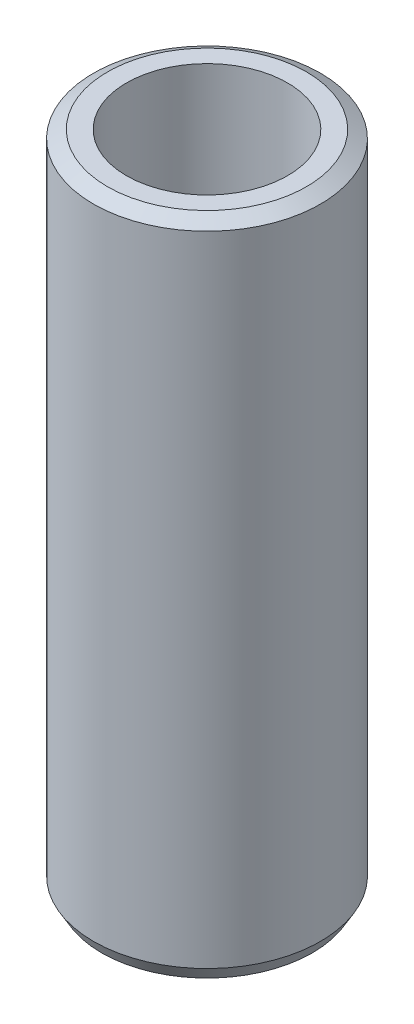
ISO-10303-21;
HEADER;
FILE_DESCRIPTION(('STEP AP214'),'2;1');
FILE_NAME('part.step','',(''),(''),'','','');
FILE_SCHEMA(('AUTOMOTIVE_DESIGN { 1 0 10303 214 1 1 1 1 }'));
ENDSEC;
DATA;
#1=APPLICATION_CONTEXT('core data for automotive mechanical design processes');
#2=APPLICATION_PROTOCOL_DEFINITION('international standard','automotive_design',2000,#1);
#3=PRODUCT_CONTEXT('',#1,'mechanical');
#4=PRODUCT('Part','Part','',(#3));
#5=PRODUCT_RELATED_PRODUCT_CATEGORY('part','',(#4));
#6=PRODUCT_DEFINITION_FORMATION('','',#4);
#7=PRODUCT_DEFINITION_CONTEXT('part definition',#1,'design');
#8=PRODUCT_DEFINITION('design','',#6,#7);
#9=PRODUCT_DEFINITION_SHAPE('','',#8);
#10=(LENGTH_UNIT() NAMED_UNIT(*) SI_UNIT(.MILLI.,.METRE.));
#11=(NAMED_UNIT(*) PLANE_ANGLE_UNIT() SI_UNIT($,.RADIAN.));
#12=(NAMED_UNIT(*) SI_UNIT($,.STERADIAN.) SOLID_ANGLE_UNIT());
#13=UNCERTAINTY_MEASURE_WITH_UNIT(LENGTH_MEASURE(1.E-05),#10,'distance_accuracy_value','');
#14=(GEOMETRIC_REPRESENTATION_CONTEXT(3) GLOBAL_UNCERTAINTY_ASSIGNED_CONTEXT((#13)) GLOBAL_UNIT_ASSIGNED_CONTEXT((#10,
#11,#12)) REPRESENTATION_CONTEXT('',''));
#15=CARTESIAN_POINT('',(0.,0.,0.));
#16=DIRECTION('',(0.,0.,1.));
#17=DIRECTION('',(1.,0.,0.));
#18=AXIS2_PLACEMENT_3D('',#15,#16,#17);
#19=CARTESIAN_POINT('',(0.,174.641646215328,0.));
#20=DIRECTION('',(0.,-1.,0.));
#21=DIRECTION('',(0.,0.,-1.));
#22=AXIS2_PLACEMENT_3D('',#19,#20,#21);
#23=CYLINDRICAL_SURFACE('',#22,30.);
#24=CARTESIAN_POINT('',(0.,172.50860545055,0.));
#25=DIRECTION('',(0.,1.,0.));
#26=DIRECTION('',(0.,0.,1.));
#27=AXIS2_PLACEMENT_3D('',#24,#25,#26);
#28=CIRCLE('',#27,30.);
#29=CARTESIAN_POINT('',(0.,172.50860545055,30.));
#30=VERTEX_POINT('',#29);
#31=EDGE_CURVE('E50',#30,#30,#28,.F.);
#32=ORIENTED_EDGE('',*,*,#31,.T.);
#33=EDGE_LOOP('',(#32));
#34=FACE_BOUND('',#33,.T.);
#35=CARTESIAN_POINT('',(0.,3.69453497921121,0.));
#36=DIRECTION('',(0.,1.,0.));
#37=DIRECTION('',(0.,0.,1.));
#38=AXIS2_PLACEMENT_3D('',#35,#36,#37);
#39=CIRCLE('',#38,30.);
#40=CARTESIAN_POINT('',(0.,3.69453497921121,30.));
#41=VERTEX_POINT('',#40);
#42=EDGE_CURVE('E51',#41,#41,#39,.T.);
#43=ORIENTED_EDGE('',*,*,#42,.T.);
#44=EDGE_LOOP('',(#43));
#45=FACE_BOUND('',#44,.T.);
#46=ADVANCED_FACE('F39',(#34,#45),#23,.T.);
#47=CARTESIAN_POINT('',(0.,174.641646215328,0.));
#48=DIRECTION('',(0.,1.,0.));
#49=DIRECTION('',(0.,0.,1.));
#50=AXIS2_PLACEMENT_3D('',#47,#48,#49);
#51=PLANE('',#50);
#52=CARTESIAN_POINT('',(0.,174.641646215328,0.));
#53=DIRECTION('',(0.,1.,0.));
#54=DIRECTION('',(0.,0.,1.));
#55=AXIS2_PLACEMENT_3D('',#52,#53,#54);
#56=CIRCLE('',#55,26.3054650207888);
#57=CARTESIAN_POINT('',(0.,174.641646215328,26.3054650207888));
#58=VERTEX_POINT('',#57);
#59=EDGE_CURVE('E54',#58,#58,#56,.T.);
#60=ORIENTED_EDGE('',*,*,#59,.T.);
#61=EDGE_LOOP('',(#60));
#62=FACE_BOUND('',#61,.T.);
#63=CARTESIAN_POINT('',(0.,174.641646215328,0.));
#64=DIRECTION('',(0.,1.,0.));
#65=DIRECTION('',(0.,0.,1.));
#66=AXIS2_PLACEMENT_3D('',#63,#64,#65);
#67=CIRCLE('',#66,21.2861476965472);
#68=CARTESIAN_POINT('',(0.,174.641646215328,21.2861476965472));
#69=VERTEX_POINT('',#68);
#70=EDGE_CURVE('E58',#69,#69,#67,.T.);
#71=ORIENTED_EDGE('',*,*,#70,.F.);
#72=EDGE_LOOP('',(#71));
#73=FACE_BOUND('',#72,.T.);
#74=ADVANCED_FACE('F69',(#62,#73),#51,.T.);
#75=CARTESIAN_POINT('',(0.,0.,0.));
#76=DIRECTION('',(0.,1.,0.));
#77=DIRECTION('',(0.,0.,1.));
#78=AXIS2_PLACEMENT_3D('',#75,#76,#77);
#79=PLANE('',#78);
#80=CARTESIAN_POINT('',(0.,0.,0.));
#81=DIRECTION('',(0.,1.,0.));
#82=DIRECTION('',(0.,0.,1.));
#83=AXIS2_PLACEMENT_3D('',#80,#81,#82);
#84=CIRCLE('',#83,27.8669592352219);
#85=CARTESIAN_POINT('',(0.,0.,27.8669592352219));
#86=VERTEX_POINT('',#85);
#87=EDGE_CURVE('E10',#86,#86,#84,.F.);
#88=ORIENTED_EDGE('',*,*,#87,.T.);
#89=EDGE_LOOP('',(#88));
#90=FACE_BOUND('',#89,.T.);
#91=CARTESIAN_POINT('',(0.,0.,0.));
#92=DIRECTION('',(0.,1.,0.));
#93=DIRECTION('',(0.,0.,1.));
#94=AXIS2_PLACEMENT_3D('',#91,#92,#93);
#95=CIRCLE('',#94,21.2861476965472);
#96=CARTESIAN_POINT('',(0.,0.,21.2861476965472));
#97=VERTEX_POINT('',#96);
#98=EDGE_CURVE('E63',#97,#97,#95,.T.);
#99=ORIENTED_EDGE('',*,*,#98,.T.);
#100=EDGE_LOOP('',(#99));
#101=FACE_BOUND('',#100,.T.);
#102=ADVANCED_FACE('F75',(#90,#101),#79,.F.);
#103=CARTESIAN_POINT('',(0.,174.641646215328,0.));
#104=DIRECTION('',(0.,-1.,0.));
#105=DIRECTION('',(0.,0.,-1.));
#106=AXIS2_PLACEMENT_3D('',#103,#104,#105);
#107=CYLINDRICAL_SURFACE('',#106,21.2861476965472);
#108=ORIENTED_EDGE('',*,*,#70,.T.);
#109=EDGE_LOOP('',(#108));
#110=FACE_BOUND('',#109,.T.);
#111=ORIENTED_EDGE('',*,*,#98,.F.);
#112=EDGE_LOOP('',(#111));
#113=FACE_BOUND('',#112,.T.);
#114=ADVANCED_FACE('F70',(#110,#113),#107,.F.);
#115=CARTESIAN_POINT('',(0.,174.641646215328,0.));
#116=DIRECTION('',(0.,-1.,0.));
#117=DIRECTION('',(0.,0.,-1.));
#118=AXIS2_PLACEMENT_3D('',#115,#116,#117);
#119=CONICAL_SURFACE('',#118,26.3054650207888,1.04719755119659);
#120=ORIENTED_EDGE('',*,*,#31,.F.);
#121=EDGE_LOOP('',(#120));
#122=FACE_BOUND('',#121,.T.);
#123=ORIENTED_EDGE('',*,*,#59,.F.);
#124=EDGE_LOOP('',(#123));
#125=FACE_BOUND('',#124,.T.);
#126=ADVANCED_FACE('F81',(#122,#125),#119,.T.);
#127=CARTESIAN_POINT('',(0.,3.69453497921121,0.));
#128=DIRECTION('',(0.,1.,0.));
#129=DIRECTION('',(0.,0.,1.));
#130=AXIS2_PLACEMENT_3D('',#127,#128,#129);
#131=CONICAL_SURFACE('',#130,30.,0.523598775598304);
#132=ORIENTED_EDGE('',*,*,#87,.F.);
#133=EDGE_LOOP('',(#132));
#134=FACE_BOUND('',#133,.T.);
#135=ORIENTED_EDGE('',*,*,#42,.F.);
#136=EDGE_LOOP('',(#135));
#137=FACE_BOUND('',#136,.T.);
#138=ADVANCED_FACE('F45',(#134,#137),#131,.T.);
#139=CLOSED_SHELL('',(#46,#74,#102,#114,#126,#138));
#140=MANIFOLD_SOLID_BREP('B2',#139);
#141=ADVANCED_BREP_SHAPE_REPRESENTATION('',(#18,#140),#14);
#142=SHAPE_DEFINITION_REPRESENTATION(#9,#141);
ENDSEC;
END-ISO-10303-21;
